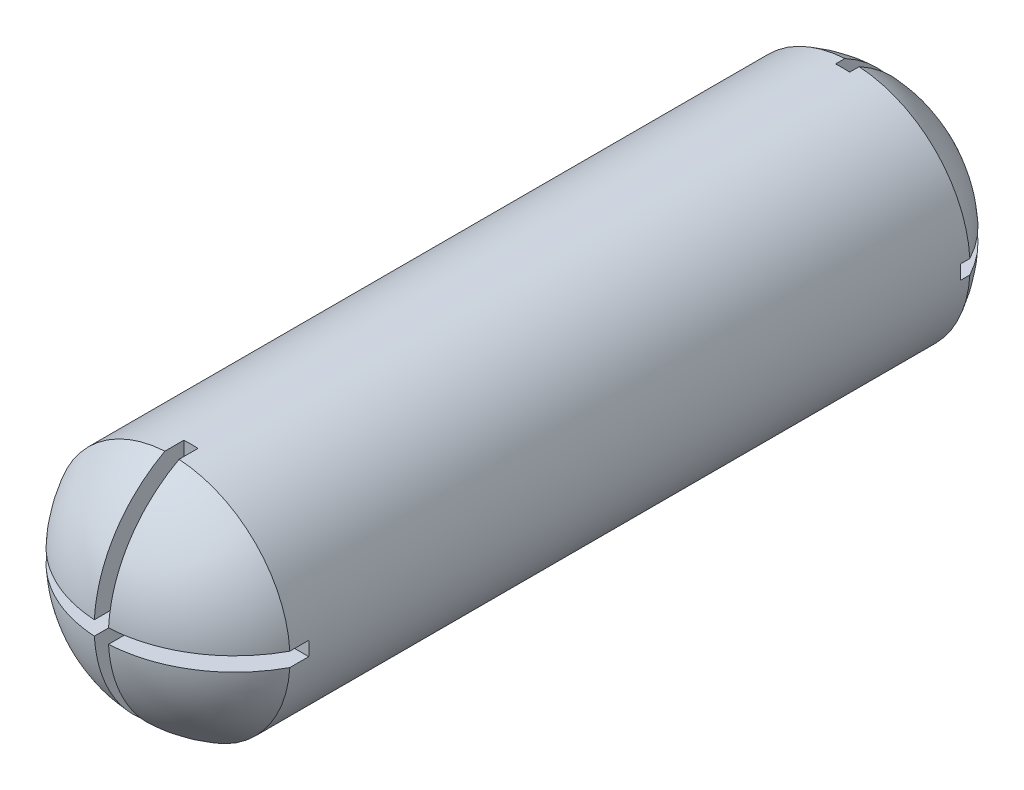
ISO-10303-21;
HEADER;
FILE_DESCRIPTION(('STEP AP214'),'2;1');
FILE_NAME('part.step','',(''),(''),'','','');
FILE_SCHEMA(('AUTOMOTIVE_DESIGN { 1 0 10303 214 1 1 1 1 }'));
ENDSEC;
DATA;
#1=APPLICATION_CONTEXT('core data for automotive mechanical design processes');
#2=APPLICATION_PROTOCOL_DEFINITION('international standard','automotive_design',2000,#1);
#3=PRODUCT_CONTEXT('',#1,'mechanical');
#4=PRODUCT('Part','Part','',(#3));
#5=PRODUCT_RELATED_PRODUCT_CATEGORY('part','',(#4));
#6=PRODUCT_DEFINITION_FORMATION('','',#4);
#7=PRODUCT_DEFINITION_CONTEXT('part definition',#1,'design');
#8=PRODUCT_DEFINITION('design','',#6,#7);
#9=PRODUCT_DEFINITION_SHAPE('','',#8);
#10=(LENGTH_UNIT() NAMED_UNIT(*) SI_UNIT(.MILLI.,.METRE.));
#11=(NAMED_UNIT(*) PLANE_ANGLE_UNIT() SI_UNIT($,.RADIAN.));
#12=(NAMED_UNIT(*) SI_UNIT($,.STERADIAN.) SOLID_ANGLE_UNIT());
#13=UNCERTAINTY_MEASURE_WITH_UNIT(LENGTH_MEASURE(1.E-05),#10,'distance_accuracy_value','');
#14=(GEOMETRIC_REPRESENTATION_CONTEXT(3) GLOBAL_UNCERTAINTY_ASSIGNED_CONTEXT((#13)) GLOBAL_UNIT_ASSIGNED_CONTEXT((#10,
#11,#12)) REPRESENTATION_CONTEXT('',''));
#15=CARTESIAN_POINT('',(0.,0.,0.));
#16=DIRECTION('',(0.,0.,1.));
#17=DIRECTION('',(1.,0.,0.));
#18=AXIS2_PLACEMENT_3D('',#15,#16,#17);
#19=CARTESIAN_POINT('',(0.,0.,144.));
#20=DIRECTION('',(0.,0.,-1.));
#21=DIRECTION('',(-1.,0.,0.));
#22=AXIS2_PLACEMENT_3D('',#19,#20,#21);
#23=CYLINDRICAL_SURFACE('',#22,25.);
#24=DIRECTION('',(0.,0.,-1.));
#25=VECTOR('',#24,1.);
#26=CARTESIAN_POINT('',(1.5,24.9549594269356,2.));
#27=LINE('',#26,#25);
#28=CARTESIAN_POINT('',(1.5,24.9549594269356,2.));
#29=VERTEX_POINT('',#28);
#30=CARTESIAN_POINT('',(1.5,24.9549594269356,0.));
#31=VERTEX_POINT('',#30);
#32=EDGE_CURVE('E359',#29,#31,#27,.T.);
#33=ORIENTED_EDGE('',*,*,#32,.F.);
#34=CARTESIAN_POINT('',(0.,0.,2.));
#35=DIRECTION('',(0.,0.,1.));
#36=DIRECTION('',(1.,0.,0.));
#37=AXIS2_PLACEMENT_3D('',#34,#35,#36);
#38=CIRCLE('',#37,25.);
#39=CARTESIAN_POINT('',(-1.5,24.9549594269356,2.));
#40=VERTEX_POINT('',#39);
#41=EDGE_CURVE('E288',#29,#40,#38,.T.);
#42=ORIENTED_EDGE('',*,*,#41,.T.);
#43=DIRECTION('',(0.,0.,-1.));
#44=VECTOR('',#43,1.);
#45=CARTESIAN_POINT('',(-1.5,24.9549594269356,2.));
#46=LINE('',#45,#44);
#47=CARTESIAN_POINT('',(-1.5,24.9549594269356,0.));
#48=VERTEX_POINT('',#47);
#49=EDGE_CURVE('E355',#40,#48,#46,.T.);
#50=ORIENTED_EDGE('',*,*,#49,.T.);
#51=CARTESIAN_POINT('',(0.,0.,0.));
#52=DIRECTION('',(0.,0.,1.));
#53=DIRECTION('',(1.,0.,0.));
#54=AXIS2_PLACEMENT_3D('',#51,#52,#53);
#55=CIRCLE('',#54,25.);
#56=CARTESIAN_POINT('',(-24.9549594269356,1.5,0.));
#57=VERTEX_POINT('',#56);
#58=EDGE_CURVE('E374',#48,#57,#55,.T.);
#59=ORIENTED_EDGE('',*,*,#58,.T.);
#60=DIRECTION('',(0.,0.,-1.));
#61=VECTOR('',#60,1.);
#62=CARTESIAN_POINT('',(-24.9549594269356,1.5,2.));
#63=LINE('',#62,#61);
#64=CARTESIAN_POINT('',(-24.9549594269356,1.5,2.));
#65=VERTEX_POINT('',#64);
#66=EDGE_CURVE('E348',#65,#57,#63,.T.);
#67=ORIENTED_EDGE('',*,*,#66,.F.);
#68=CARTESIAN_POINT('',(-24.9549594269356,-1.5,2.));
#69=VERTEX_POINT('',#68);
#70=EDGE_CURVE('E294',#65,#69,#38,.T.);
#71=ORIENTED_EDGE('',*,*,#70,.T.);
#72=DIRECTION('',(0.,0.,-1.));
#73=VECTOR('',#72,1.);
#74=CARTESIAN_POINT('',(-24.9549594269356,-1.5,2.));
#75=LINE('',#74,#73);
#76=CARTESIAN_POINT('',(-24.9549594269356,-1.5,0.));
#77=VERTEX_POINT('',#76);
#78=EDGE_CURVE('E344',#69,#77,#75,.T.);
#79=ORIENTED_EDGE('',*,*,#78,.T.);
#80=CARTESIAN_POINT('',(-1.5,-24.9549594269356,0.));
#81=VERTEX_POINT('',#80);
#82=EDGE_CURVE('E725',#77,#81,#55,.T.);
#83=ORIENTED_EDGE('',*,*,#82,.T.);
#84=DIRECTION('',(0.,0.,-1.));
#85=VECTOR('',#84,1.);
#86=CARTESIAN_POINT('',(-1.5,-24.9549594269356,2.));
#87=LINE('',#86,#85);
#88=CARTESIAN_POINT('',(-1.5,-24.9549594269356,2.));
#89=VERTEX_POINT('',#88);
#90=EDGE_CURVE('E337',#89,#81,#87,.T.);
#91=ORIENTED_EDGE('',*,*,#90,.F.);
#92=CARTESIAN_POINT('',(1.5,-24.9549594269356,2.));
#93=VERTEX_POINT('',#92);
#94=EDGE_CURVE('E309',#89,#93,#38,.T.);
#95=ORIENTED_EDGE('',*,*,#94,.T.);
#96=DIRECTION('',(0.,0.,-1.));
#97=VECTOR('',#96,1.);
#98=CARTESIAN_POINT('',(1.5,-24.9549594269356,2.));
#99=LINE('',#98,#97);
#100=CARTESIAN_POINT('',(1.5,-24.9549594269356,0.));
#101=VERTEX_POINT('',#100);
#102=EDGE_CURVE('E333',#93,#101,#99,.T.);
#103=ORIENTED_EDGE('',*,*,#102,.T.);
#104=CARTESIAN_POINT('',(24.9549594269356,-1.5,0.));
#105=VERTEX_POINT('',#104);
#106=EDGE_CURVE('E362',#101,#105,#55,.T.);
#107=ORIENTED_EDGE('',*,*,#106,.T.);
#108=DIRECTION('',(0.,0.,-1.));
#109=VECTOR('',#108,1.);
#110=CARTESIAN_POINT('',(24.9549594269356,-1.5,2.));
#111=LINE('',#110,#109);
#112=CARTESIAN_POINT('',(24.9549594269356,-1.5,2.));
#113=VERTEX_POINT('',#112);
#114=EDGE_CURVE('E326',#113,#105,#111,.T.);
#115=ORIENTED_EDGE('',*,*,#114,.F.);
#116=CARTESIAN_POINT('',(24.9549594269356,1.5,2.));
#117=VERTEX_POINT('',#116);
#118=EDGE_CURVE('E293',#113,#117,#38,.T.);
#119=ORIENTED_EDGE('',*,*,#118,.T.);
#120=DIRECTION('',(0.,0.,-1.));
#121=VECTOR('',#120,1.);
#122=CARTESIAN_POINT('',(24.9549594269356,1.5,2.));
#123=LINE('',#122,#121);
#124=CARTESIAN_POINT('',(24.9549594269356,1.5,0.));
#125=VERTEX_POINT('',#124);
#126=EDGE_CURVE('E322',#117,#125,#123,.T.);
#127=ORIENTED_EDGE('',*,*,#126,.T.);
#128=EDGE_CURVE('E370',#125,#31,#55,.T.);
#129=ORIENTED_EDGE('',*,*,#128,.T.);
#130=EDGE_LOOP('',(#33,#42,#50,#59,#67,#71,#79,#83,#91,#95,#103,#107,#115,#119,#127,#129));
#131=FACE_BOUND('',#130,.T.);
#132=DIRECTION('',(0.,0.,-1.));
#133=VECTOR('',#132,1.);
#134=CARTESIAN_POINT('',(-1.5,24.9549594269356,144.));
#135=LINE('',#134,#133);
#136=CARTESIAN_POINT('',(-1.5,24.9549594269356,140.));
#137=VERTEX_POINT('',#136);
#138=CARTESIAN_POINT('',(-1.5,24.9549594269356,144.));
#139=VERTEX_POINT('',#138);
#140=EDGE_CURVE('E268',#137,#139,#135,.F.);
#141=ORIENTED_EDGE('',*,*,#140,.F.);
#142=CARTESIAN_POINT('',(0.,0.,140.));
#143=DIRECTION('',(0.,0.,1.));
#144=DIRECTION('',(1.,0.,0.));
#145=AXIS2_PLACEMENT_3D('',#142,#143,#144);
#146=CIRCLE('',#145,25.);
#147=CARTESIAN_POINT('',(1.5,24.9549594269356,140.));
#148=VERTEX_POINT('',#147);
#149=EDGE_CURVE('E11',#148,#137,#146,.T.);
#150=ORIENTED_EDGE('',*,*,#149,.F.);
#151=DIRECTION('',(0.,0.,-1.));
#152=VECTOR('',#151,1.);
#153=CARTESIAN_POINT('',(1.5,24.9549594269356,144.));
#154=LINE('',#153,#152);
#155=CARTESIAN_POINT('',(1.5,24.9549594269356,144.));
#156=VERTEX_POINT('',#155);
#157=EDGE_CURVE('E264',#148,#156,#154,.F.);
#158=ORIENTED_EDGE('',*,*,#157,.T.);
#159=CARTESIAN_POINT('',(0.,0.,144.));
#160=DIRECTION('',(0.,0.,1.));
#161=DIRECTION('',(1.,0.,0.));
#162=AXIS2_PLACEMENT_3D('',#159,#160,#161);
#163=CIRCLE('',#162,25.);
#164=CARTESIAN_POINT('',(24.9549594269356,1.5,144.));
#165=VERTEX_POINT('',#164);
#166=EDGE_CURVE('E363',#165,#156,#163,.T.);
#167=ORIENTED_EDGE('',*,*,#166,.F.);
#168=DIRECTION('',(0.,0.,-1.));
#169=VECTOR('',#168,1.);
#170=CARTESIAN_POINT('',(24.9549594269356,1.5,144.));
#171=LINE('',#170,#169);
#172=CARTESIAN_POINT('',(24.9549594269356,1.5,140.));
#173=VERTEX_POINT('',#172);
#174=EDGE_CURVE('E261',#173,#165,#171,.F.);
#175=ORIENTED_EDGE('',*,*,#174,.F.);
#176=CARTESIAN_POINT('',(24.9549594269356,-1.5,140.));
#177=VERTEX_POINT('',#176);
#178=EDGE_CURVE('E43',#177,#173,#146,.T.);
#179=ORIENTED_EDGE('',*,*,#178,.F.);
#180=DIRECTION('',(0.,0.,-1.));
#181=VECTOR('',#180,1.);
#182=CARTESIAN_POINT('',(24.9549594269356,-1.5,144.));
#183=LINE('',#182,#181);
#184=CARTESIAN_POINT('',(24.9549594269356,-1.5,144.));
#185=VERTEX_POINT('',#184);
#186=EDGE_CURVE('E223',#177,#185,#183,.F.);
#187=ORIENTED_EDGE('',*,*,#186,.T.);
#188=CARTESIAN_POINT('',(1.5,-24.9549594269356,144.));
#189=VERTEX_POINT('',#188);
#190=EDGE_CURVE('E369',#189,#185,#163,.T.);
#191=ORIENTED_EDGE('',*,*,#190,.F.);
#192=DIRECTION('',(0.,0.,-1.));
#193=VECTOR('',#192,1.);
#194=CARTESIAN_POINT('',(1.5,-24.9549594269356,144.));
#195=LINE('',#194,#193);
#196=CARTESIAN_POINT('',(1.5,-24.9549594269356,140.));
#197=VERTEX_POINT('',#196);
#198=EDGE_CURVE('E281',#189,#197,#195,.T.);
#199=ORIENTED_EDGE('',*,*,#198,.T.);
#200=CARTESIAN_POINT('',(-1.5,-24.9549594269356,140.));
#201=VERTEX_POINT('',#200);
#202=EDGE_CURVE('E208',#201,#197,#146,.T.);
#203=ORIENTED_EDGE('',*,*,#202,.F.);
#204=DIRECTION('',(0.,0.,-1.));
#205=VECTOR('',#204,1.);
#206=CARTESIAN_POINT('',(-1.5,-24.9549594269356,144.));
#207=LINE('',#206,#205);
#208=CARTESIAN_POINT('',(-1.5,-24.9549594269356,144.));
#209=VERTEX_POINT('',#208);
#210=EDGE_CURVE('E278',#209,#201,#207,.T.);
#211=ORIENTED_EDGE('',*,*,#210,.F.);
#212=CARTESIAN_POINT('',(-24.9549594269356,-1.5,144.));
#213=VERTEX_POINT('',#212);
#214=EDGE_CURVE('E446',#213,#209,#163,.T.);
#215=ORIENTED_EDGE('',*,*,#214,.F.);
#216=DIRECTION('',(0.,0.,-1.));
#217=VECTOR('',#216,1.);
#218=CARTESIAN_POINT('',(-24.9549594269356,-1.5,144.));
#219=LINE('',#218,#217);
#220=CARTESIAN_POINT('',(-24.9549594269356,-1.5,140.));
#221=VERTEX_POINT('',#220);
#222=EDGE_CURVE('E274',#213,#221,#219,.T.);
#223=ORIENTED_EDGE('',*,*,#222,.T.);
#224=CARTESIAN_POINT('',(-24.9549594269356,1.5,140.));
#225=VERTEX_POINT('',#224);
#226=EDGE_CURVE('E49',#225,#221,#146,.T.);
#227=ORIENTED_EDGE('',*,*,#226,.F.);
#228=DIRECTION('',(0.,0.,-1.));
#229=VECTOR('',#228,1.);
#230=CARTESIAN_POINT('',(-24.9549594269356,1.5,144.));
#231=LINE('',#230,#229);
#232=CARTESIAN_POINT('',(-24.9549594269356,1.5,144.));
#233=VERTEX_POINT('',#232);
#234=EDGE_CURVE('E271',#233,#225,#231,.T.);
#235=ORIENTED_EDGE('',*,*,#234,.F.);
#236=EDGE_CURVE('E368',#139,#233,#163,.T.);
#237=ORIENTED_EDGE('',*,*,#236,.F.);
#238=EDGE_LOOP('',(#141,#150,#158,#167,#175,#179,#187,#191,#199,#203,#211,#215,#223,#227,#235,#237));
#239=FACE_BOUND('',#238,.T.);
#240=ADVANCED_FACE('F39',(#131,#239),#23,.T.);
#241=CARTESIAN_POINT('',(0.,0.,130.666666666667));
#242=DIRECTION('',(0.,0.,1.));
#243=DIRECTION('',(1.,0.,0.));
#244=AXIS2_PLACEMENT_3D('',#241,#242,#243);
#245=SPHERICAL_SURFACE('',#244,28.3333333333333);
#246=ORIENTED_EDGE('',*,*,#214,.T.);
#247=CARTESIAN_POINT('',(-1.5,0.,130.666666666667));
#248=DIRECTION('',(1.,0.,0.));
#249=DIRECTION('',(0.,0.,-1.));
#250=AXIS2_PLACEMENT_3D('',#247,#248,#249);
#251=CIRCLE('',#250,28.2935995903275);
#252=CARTESIAN_POINT('',(-1.5,-1.5,158.920476635904));
#253=VERTEX_POINT('',#252);
#254=EDGE_CURVE('E424',#209,#253,#251,.F.);
#255=ORIENTED_EDGE('',*,*,#254,.T.);
#256=CARTESIAN_POINT('',(0.,-1.5,130.666666666667));
#257=DIRECTION('',(0.,-1.,0.));
#258=DIRECTION('',(0.,0.,-1.));
#259=AXIS2_PLACEMENT_3D('',#256,#257,#258);
#260=CIRCLE('',#259,28.2935995903275);
#261=EDGE_CURVE('E422',#213,#253,#260,.F.);
#262=ORIENTED_EDGE('',*,*,#261,.F.);
#263=EDGE_LOOP('',(#246,#255,#262));
#264=FACE_BOUND('',#263,.T.);
#265=ADVANCED_FACE('F475',(#264),#245,.T.);
#266=ORIENTED_EDGE('',*,*,#236,.T.);
#267=CARTESIAN_POINT('',(0.,1.5,130.666666666667));
#268=DIRECTION('',(0.,-1.,0.));
#269=DIRECTION('',(0.,0.,-1.));
#270=AXIS2_PLACEMENT_3D('',#267,#268,#269);
#271=CIRCLE('',#270,28.2935995903275);
#272=CARTESIAN_POINT('',(-1.5,1.5,158.920476635904));
#273=VERTEX_POINT('',#272);
#274=EDGE_CURVE('E418',#233,#273,#271,.F.);
#275=ORIENTED_EDGE('',*,*,#274,.T.);
#276=CARTESIAN_POINT('',(-1.5,0.,130.666666666667));
#277=DIRECTION('',(1.,0.,0.));
#278=DIRECTION('',(0.,0.,-1.));
#279=AXIS2_PLACEMENT_3D('',#276,#277,#278);
#280=CIRCLE('',#279,28.2935995903275);
#281=EDGE_CURVE('E414',#273,#139,#280,.F.);
#282=ORIENTED_EDGE('',*,*,#281,.T.);
#283=EDGE_LOOP('',(#266,#275,#282));
#284=FACE_BOUND('',#283,.T.);
#285=ADVANCED_FACE('F473',(#284),#245,.T.);
#286=CARTESIAN_POINT('',(1.5,0.,130.666666666667));
#287=DIRECTION('',(1.,0.,0.));
#288=DIRECTION('',(0.,0.,-1.));
#289=AXIS2_PLACEMENT_3D('',#286,#287,#288);
#290=CIRCLE('',#289,28.2935995903275);
#291=CARTESIAN_POINT('',(1.5,1.5,158.920476635904));
#292=VERTEX_POINT('',#291);
#293=EDGE_CURVE('E411',#292,#156,#290,.F.);
#294=ORIENTED_EDGE('',*,*,#293,.F.);
#295=CARTESIAN_POINT('',(0.,1.5,130.666666666667));
#296=DIRECTION('',(0.,-1.,0.));
#297=DIRECTION('',(0.,0.,-1.));
#298=AXIS2_PLACEMENT_3D('',#295,#296,#297);
#299=CIRCLE('',#298,28.2935995903275);
#300=EDGE_CURVE('E407',#292,#165,#299,.F.);
#301=ORIENTED_EDGE('',*,*,#300,.T.);
#302=ORIENTED_EDGE('',*,*,#166,.T.);
#303=EDGE_LOOP('',(#294,#301,#302));
#304=FACE_BOUND('',#303,.T.);
#305=ADVANCED_FACE('F461',(#304),#245,.T.);
#306=CARTESIAN_POINT('',(0.,0.,13.3333333333333));
#307=DIRECTION('',(0.,0.,1.));
#308=DIRECTION('',(1.,0.,0.));
#309=AXIS2_PLACEMENT_3D('',#306,#307,#308);
#310=SPHERICAL_SURFACE('',#309,28.3333333333333);
#311=ORIENTED_EDGE('',*,*,#58,.F.);
#312=CARTESIAN_POINT('',(-1.5,0.,13.3333333333333));
#313=DIRECTION('',(-1.,0.,0.));
#314=DIRECTION('',(0.,-1.,0.));
#315=AXIS2_PLACEMENT_3D('',#312,#313,#314);
#316=CIRCLE('',#315,28.2935995903275);
#317=CARTESIAN_POINT('',(-1.5,1.5,-14.9204766359041));
#318=VERTEX_POINT('',#317);
#319=EDGE_CURVE('E398',#48,#318,#316,.T.);
#320=ORIENTED_EDGE('',*,*,#319,.T.);
#321=CARTESIAN_POINT('',(0.,1.5,13.3333333333333));
#322=DIRECTION('',(0.,-1.,0.));
#323=DIRECTION('',(1.,0.,0.));
#324=AXIS2_PLACEMENT_3D('',#321,#322,#323);
#325=CIRCLE('',#324,28.2935995903275);
#326=EDGE_CURVE('E395',#57,#318,#325,.T.);
#327=ORIENTED_EDGE('',*,*,#326,.F.);
#328=EDGE_LOOP('',(#311,#320,#327));
#329=FACE_BOUND('',#328,.T.);
#330=ADVANCED_FACE('F480',(#329),#310,.T.);
#331=CARTESIAN_POINT('',(1.5,0.,13.3333333333333));
#332=DIRECTION('',(-1.,0.,0.));
#333=DIRECTION('',(0.,-1.,0.));
#334=AXIS2_PLACEMENT_3D('',#331,#332,#333);
#335=CIRCLE('',#334,28.2935995903275);
#336=CARTESIAN_POINT('',(1.5,-1.5,-14.9204766359041));
#337=VERTEX_POINT('',#336);
#338=EDGE_CURVE('E384',#337,#101,#335,.T.);
#339=ORIENTED_EDGE('',*,*,#338,.F.);
#340=CARTESIAN_POINT('',(0.,-1.5,13.3333333333333));
#341=DIRECTION('',(0.,-1.,0.));
#342=DIRECTION('',(1.,0.,0.));
#343=AXIS2_PLACEMENT_3D('',#340,#341,#342);
#344=CIRCLE('',#343,28.2935995903275);
#345=EDGE_CURVE('E380',#337,#105,#344,.T.);
#346=ORIENTED_EDGE('',*,*,#345,.T.);
#347=ORIENTED_EDGE('',*,*,#106,.F.);
#348=EDGE_LOOP('',(#339,#346,#347));
#349=FACE_BOUND('',#348,.T.);
#350=ADVANCED_FACE('F700',(#349),#310,.T.);
#351=CARTESIAN_POINT('',(1.5,0.,13.3333333333333));
#352=DIRECTION('',(-1.,0.,0.));
#353=DIRECTION('',(0.,-1.,0.));
#354=AXIS2_PLACEMENT_3D('',#351,#352,#353);
#355=CIRCLE('',#354,28.2935995903275);
#356=CARTESIAN_POINT('',(1.5,1.5,-14.9204766359041));
#357=VERTEX_POINT('',#356);
#358=EDGE_CURVE('E377',#31,#357,#355,.T.);
#359=ORIENTED_EDGE('',*,*,#358,.F.);
#360=ORIENTED_EDGE('',*,*,#128,.F.);
#361=CARTESIAN_POINT('',(0.,1.5,13.3333333333333));
#362=DIRECTION('',(0.,-1.,0.));
#363=DIRECTION('',(1.,0.,0.));
#364=AXIS2_PLACEMENT_3D('',#361,#362,#363);
#365=CIRCLE('',#364,28.2935995903275);
#366=EDGE_CURVE('E367',#357,#125,#365,.T.);
#367=ORIENTED_EDGE('',*,*,#366,.F.);
#368=EDGE_LOOP('',(#359,#360,#367));
#369=FACE_BOUND('',#368,.T.);
#370=ADVANCED_FACE('F690',(#369),#310,.T.);
#371=CARTESIAN_POINT('',(1.5,0.,130.666666666667));
#372=DIRECTION('',(1.,0.,0.));
#373=DIRECTION('',(0.,0.,-1.));
#374=AXIS2_PLACEMENT_3D('',#371,#372,#373);
#375=CIRCLE('',#374,28.2935995903275);
#376=CARTESIAN_POINT('',(1.5,-1.5,158.920476635904));
#377=VERTEX_POINT('',#376);
#378=EDGE_CURVE('E215',#189,#377,#375,.F.);
#379=ORIENTED_EDGE('',*,*,#378,.F.);
#380=ORIENTED_EDGE('',*,*,#190,.T.);
#381=CARTESIAN_POINT('',(0.,-1.5,130.666666666667));
#382=DIRECTION('',(0.,-1.,0.));
#383=DIRECTION('',(0.,0.,-1.));
#384=AXIS2_PLACEMENT_3D('',#381,#382,#383);
#385=CIRCLE('',#384,28.2935995903275);
#386=EDGE_CURVE('E402',#377,#185,#385,.F.);
#387=ORIENTED_EDGE('',*,*,#386,.F.);
#388=EDGE_LOOP('',(#379,#380,#387));
#389=FACE_BOUND('',#388,.T.);
#390=ADVANCED_FACE('F454',(#389),#245,.T.);
#391=ORIENTED_EDGE('',*,*,#82,.F.);
#392=CARTESIAN_POINT('',(0.,-1.5,13.3333333333333));
#393=DIRECTION('',(0.,-1.,0.));
#394=DIRECTION('',(1.,0.,0.));
#395=AXIS2_PLACEMENT_3D('',#392,#393,#394);
#396=CIRCLE('',#395,28.2935995903275);
#397=CARTESIAN_POINT('',(-1.5,-1.5,-14.9204766359041));
#398=VERTEX_POINT('',#397);
#399=EDGE_CURVE('E391',#77,#398,#396,.T.);
#400=ORIENTED_EDGE('',*,*,#399,.T.);
#401=CARTESIAN_POINT('',(-1.5,0.,13.3333333333333));
#402=DIRECTION('',(-1.,0.,0.));
#403=DIRECTION('',(0.,-1.,0.));
#404=AXIS2_PLACEMENT_3D('',#401,#402,#403);
#405=CIRCLE('',#404,28.2935995903275);
#406=EDGE_CURVE('E387',#398,#81,#405,.T.);
#407=ORIENTED_EDGE('',*,*,#406,.T.);
#408=EDGE_LOOP('',(#391,#400,#407));
#409=FACE_BOUND('',#408,.T.);
#410=ADVANCED_FACE('F41',(#409),#310,.T.);
#411=CARTESIAN_POINT('',(1.5,0.,2.));
#412=DIRECTION('',(-1.,0.,0.));
#413=DIRECTION('',(0.,-1.,0.));
#414=AXIS2_PLACEMENT_3D('',#411,#412,#413);
#415=PLANE('',#414);
#416=ORIENTED_EDGE('',*,*,#358,.T.);
#417=DIRECTION('',(0.,0.,-1.));
#418=VECTOR('',#417,1.);
#419=CARTESIAN_POINT('',(1.5,1.5,2.));
#420=LINE('',#419,#418);
#421=CARTESIAN_POINT('',(1.5,1.5,2.));
#422=VERTEX_POINT('',#421);
#423=EDGE_CURVE('E64',#422,#357,#420,.T.);
#424=ORIENTED_EDGE('',*,*,#423,.F.);
#425=DIRECTION('',(0.,1.,0.));
#426=VECTOR('',#425,1.);
#427=CARTESIAN_POINT('',(1.5,0.,2.));
#428=LINE('',#427,#426);
#429=EDGE_CURVE('E284',#422,#29,#428,.T.);
#430=ORIENTED_EDGE('',*,*,#429,.T.);
#431=ORIENTED_EDGE('',*,*,#32,.T.);
#432=EDGE_LOOP('',(#416,#424,#430,#431));
#433=FACE_BOUND('',#432,.T.);
#434=ADVANCED_FACE('F488',(#433),#415,.T.);
#435=CARTESIAN_POINT('',(-1.5,0.,2.));
#436=DIRECTION('',(-1.,0.,0.));
#437=DIRECTION('',(0.,-1.,0.));
#438=AXIS2_PLACEMENT_3D('',#435,#436,#437);
#439=PLANE('',#438);
#440=ORIENTED_EDGE('',*,*,#49,.F.);
#441=DIRECTION('',(0.,1.,0.));
#442=VECTOR('',#441,1.);
#443=CARTESIAN_POINT('',(-1.5,0.,2.));
#444=LINE('',#443,#442);
#445=CARTESIAN_POINT('',(-1.5,1.5,2.));
#446=VERTEX_POINT('',#445);
#447=EDGE_CURVE('E292',#446,#40,#444,.T.);
#448=ORIENTED_EDGE('',*,*,#447,.F.);
#449=DIRECTION('',(0.,0.,-1.));
#450=VECTOR('',#449,1.);
#451=CARTESIAN_POINT('',(-1.5,1.5,2.));
#452=LINE('',#451,#450);
#453=EDGE_CURVE('E351',#446,#318,#452,.T.);
#454=ORIENTED_EDGE('',*,*,#453,.T.);
#455=ORIENTED_EDGE('',*,*,#319,.F.);
#456=EDGE_LOOP('',(#440,#448,#454,#455));
#457=FACE_BOUND('',#456,.T.);
#458=ADVANCED_FACE('F491',(#457),#439,.F.);
#459=CARTESIAN_POINT('',(0.,1.5,2.));
#460=DIRECTION('',(0.,-1.,0.));
#461=DIRECTION('',(1.,0.,0.));
#462=AXIS2_PLACEMENT_3D('',#459,#460,#461);
#463=PLANE('',#462);
#464=ORIENTED_EDGE('',*,*,#326,.T.);
#465=ORIENTED_EDGE('',*,*,#453,.F.);
#466=DIRECTION('',(-1.,0.,0.));
#467=VECTOR('',#466,1.);
#468=CARTESIAN_POINT('',(0.,1.5,2.));
#469=LINE('',#468,#467);
#470=EDGE_CURVE('E298',#446,#65,#469,.T.);
#471=ORIENTED_EDGE('',*,*,#470,.T.);
#472=ORIENTED_EDGE('',*,*,#66,.T.);
#473=EDGE_LOOP('',(#464,#465,#471,#472));
#474=FACE_BOUND('',#473,.T.);
#475=ADVANCED_FACE('F495',(#474),#463,.T.);
#476=CARTESIAN_POINT('',(0.,-1.5,2.));
#477=DIRECTION('',(0.,-1.,0.));
#478=DIRECTION('',(1.,0.,0.));
#479=AXIS2_PLACEMENT_3D('',#476,#477,#478);
#480=PLANE('',#479);
#481=ORIENTED_EDGE('',*,*,#78,.F.);
#482=DIRECTION('',(-1.,0.,0.));
#483=VECTOR('',#482,1.);
#484=CARTESIAN_POINT('',(0.,-1.5,2.));
#485=LINE('',#484,#483);
#486=CARTESIAN_POINT('',(-1.5,-1.5,2.));
#487=VERTEX_POINT('',#486);
#488=EDGE_CURVE('E301',#487,#69,#485,.T.);
#489=ORIENTED_EDGE('',*,*,#488,.F.);
#490=DIRECTION('',(0.,0.,-1.));
#491=VECTOR('',#490,1.);
#492=CARTESIAN_POINT('',(-1.5,-1.5,2.));
#493=LINE('',#492,#491);
#494=EDGE_CURVE('E340',#487,#398,#493,.T.);
#495=ORIENTED_EDGE('',*,*,#494,.T.);
#496=ORIENTED_EDGE('',*,*,#399,.F.);
#497=EDGE_LOOP('',(#481,#489,#495,#496));
#498=FACE_BOUND('',#497,.T.);
#499=ADVANCED_FACE('F499',(#498),#480,.F.);
#500=CARTESIAN_POINT('',(-1.5,0.,2.));
#501=DIRECTION('',(-1.,0.,0.));
#502=DIRECTION('',(0.,-1.,0.));
#503=AXIS2_PLACEMENT_3D('',#500,#501,#502);
#504=PLANE('',#503);
#505=ORIENTED_EDGE('',*,*,#494,.F.);
#506=DIRECTION('',(0.,1.,0.));
#507=VECTOR('',#506,1.);
#508=CARTESIAN_POINT('',(-1.5,0.,2.));
#509=LINE('',#508,#507);
#510=EDGE_CURVE('E305',#89,#487,#509,.T.);
#511=ORIENTED_EDGE('',*,*,#510,.F.);
#512=ORIENTED_EDGE('',*,*,#90,.T.);
#513=ORIENTED_EDGE('',*,*,#406,.F.);
#514=EDGE_LOOP('',(#505,#511,#512,#513));
#515=FACE_BOUND('',#514,.T.);
#516=ADVANCED_FACE('F503',(#515),#504,.F.);
#517=CARTESIAN_POINT('',(1.5,0.,2.));
#518=DIRECTION('',(-1.,0.,0.));
#519=DIRECTION('',(0.,-1.,0.));
#520=AXIS2_PLACEMENT_3D('',#517,#518,#519);
#521=PLANE('',#520);
#522=ORIENTED_EDGE('',*,*,#338,.T.);
#523=ORIENTED_EDGE('',*,*,#102,.F.);
#524=DIRECTION('',(0.,1.,0.));
#525=VECTOR('',#524,1.);
#526=CARTESIAN_POINT('',(1.5,0.,2.));
#527=LINE('',#526,#525);
#528=CARTESIAN_POINT('',(1.5,-1.5,2.));
#529=VERTEX_POINT('',#528);
#530=EDGE_CURVE('E310',#93,#529,#527,.T.);
#531=ORIENTED_EDGE('',*,*,#530,.T.);
#532=DIRECTION('',(0.,0.,-1.));
#533=VECTOR('',#532,1.);
#534=CARTESIAN_POINT('',(1.5,-1.5,2.));
#535=LINE('',#534,#533);
#536=EDGE_CURVE('E329',#529,#337,#535,.T.);
#537=ORIENTED_EDGE('',*,*,#536,.T.);
#538=EDGE_LOOP('',(#522,#523,#531,#537));
#539=FACE_BOUND('',#538,.T.);
#540=ADVANCED_FACE('F507',(#539),#521,.T.);
#541=CARTESIAN_POINT('',(0.,-1.5,2.));
#542=DIRECTION('',(0.,-1.,0.));
#543=DIRECTION('',(1.,0.,0.));
#544=AXIS2_PLACEMENT_3D('',#541,#542,#543);
#545=PLANE('',#544);
#546=ORIENTED_EDGE('',*,*,#536,.F.);
#547=DIRECTION('',(-1.,0.,0.));
#548=VECTOR('',#547,1.);
#549=CARTESIAN_POINT('',(0.,-1.5,2.));
#550=LINE('',#549,#548);
#551=EDGE_CURVE('E313',#113,#529,#550,.T.);
#552=ORIENTED_EDGE('',*,*,#551,.F.);
#553=ORIENTED_EDGE('',*,*,#114,.T.);
#554=ORIENTED_EDGE('',*,*,#345,.F.);
#555=EDGE_LOOP('',(#546,#552,#553,#554));
#556=FACE_BOUND('',#555,.T.);
#557=ADVANCED_FACE('F511',(#556),#545,.F.);
#558=CARTESIAN_POINT('',(0.,1.5,2.));
#559=DIRECTION('',(0.,-1.,0.));
#560=DIRECTION('',(1.,0.,0.));
#561=AXIS2_PLACEMENT_3D('',#558,#559,#560);
#562=PLANE('',#561);
#563=ORIENTED_EDGE('',*,*,#366,.T.);
#564=ORIENTED_EDGE('',*,*,#126,.F.);
#565=DIRECTION('',(-1.,0.,0.));
#566=VECTOR('',#565,1.);
#567=CARTESIAN_POINT('',(0.,1.5,2.));
#568=LINE('',#567,#566);
#569=EDGE_CURVE('E317',#117,#422,#568,.T.);
#570=ORIENTED_EDGE('',*,*,#569,.T.);
#571=ORIENTED_EDGE('',*,*,#423,.T.);
#572=EDGE_LOOP('',(#563,#564,#570,#571));
#573=FACE_BOUND('',#572,.T.);
#574=ADVANCED_FACE('F515',(#573),#562,.T.);
#575=CARTESIAN_POINT('',(0.,0.,2.));
#576=DIRECTION('',(0.,0.,1.));
#577=DIRECTION('',(1.,0.,0.));
#578=AXIS2_PLACEMENT_3D('',#575,#576,#577);
#579=PLANE('',#578);
#580=ORIENTED_EDGE('',*,*,#429,.F.);
#581=ORIENTED_EDGE('',*,*,#569,.F.);
#582=ORIENTED_EDGE('',*,*,#118,.F.);
#583=ORIENTED_EDGE('',*,*,#551,.T.);
#584=ORIENTED_EDGE('',*,*,#530,.F.);
#585=ORIENTED_EDGE('',*,*,#94,.F.);
#586=ORIENTED_EDGE('',*,*,#510,.T.);
#587=ORIENTED_EDGE('',*,*,#488,.T.);
#588=ORIENTED_EDGE('',*,*,#70,.F.);
#589=ORIENTED_EDGE('',*,*,#470,.F.);
#590=ORIENTED_EDGE('',*,*,#447,.T.);
#591=ORIENTED_EDGE('',*,*,#41,.F.);
#592=EDGE_LOOP('',(#580,#581,#582,#583,#584,#585,#586,#587,#588,#589,#590,#591));
#593=FACE_BOUND('',#592,.T.);
#594=ADVANCED_FACE('F519',(#593),#579,.F.);
#595=CARTESIAN_POINT('',(0.,0.,140.));
#596=DIRECTION('',(0.,0.,1.));
#597=DIRECTION('',(1.,0.,0.));
#598=AXIS2_PLACEMENT_3D('',#595,#596,#597);
#599=PLANE('',#598);
#600=ORIENTED_EDGE('',*,*,#149,.T.);
#601=DIRECTION('',(0.,1.,0.));
#602=VECTOR('',#601,1.);
#603=CARTESIAN_POINT('',(-1.5,0.,140.));
#604=LINE('',#603,#602);
#605=CARTESIAN_POINT('',(-1.5,1.5,140.));
#606=VERTEX_POINT('',#605);
#607=EDGE_CURVE('E235',#606,#137,#604,.T.);
#608=ORIENTED_EDGE('',*,*,#607,.F.);
#609=DIRECTION('',(1.,0.,0.));
#610=VECTOR('',#609,1.);
#611=CARTESIAN_POINT('',(0.,1.5,140.));
#612=LINE('',#611,#610);
#613=EDGE_CURVE('E239',#225,#606,#612,.T.);
#614=ORIENTED_EDGE('',*,*,#613,.F.);
#615=ORIENTED_EDGE('',*,*,#226,.T.);
#616=DIRECTION('',(1.,0.,0.));
#617=VECTOR('',#616,1.);
#618=CARTESIAN_POINT('',(0.,-1.5,140.));
#619=LINE('',#618,#617);
#620=CARTESIAN_POINT('',(-1.5,-1.5,140.));
#621=VERTEX_POINT('',#620);
#622=EDGE_CURVE('E242',#221,#621,#619,.T.);
#623=ORIENTED_EDGE('',*,*,#622,.T.);
#624=DIRECTION('',(0.,1.,0.));
#625=VECTOR('',#624,1.);
#626=CARTESIAN_POINT('',(-1.5,0.,140.));
#627=LINE('',#626,#625);
#628=EDGE_CURVE('E219',#201,#621,#627,.T.);
#629=ORIENTED_EDGE('',*,*,#628,.F.);
#630=ORIENTED_EDGE('',*,*,#202,.T.);
#631=DIRECTION('',(0.,1.,0.));
#632=VECTOR('',#631,1.);
#633=CARTESIAN_POINT('',(1.5,0.,140.));
#634=LINE('',#633,#632);
#635=CARTESIAN_POINT('',(1.5,-1.5,140.));
#636=VERTEX_POINT('',#635);
#637=EDGE_CURVE('E202',#197,#636,#634,.T.);
#638=ORIENTED_EDGE('',*,*,#637,.T.);
#639=DIRECTION('',(1.,0.,0.));
#640=VECTOR('',#639,1.);
#641=CARTESIAN_POINT('',(0.,-1.5,140.));
#642=LINE('',#641,#640);
#643=EDGE_CURVE('E204',#636,#177,#642,.T.);
#644=ORIENTED_EDGE('',*,*,#643,.T.);
#645=ORIENTED_EDGE('',*,*,#178,.T.);
#646=DIRECTION('',(1.,0.,0.));
#647=VECTOR('',#646,1.);
#648=CARTESIAN_POINT('',(0.,1.5,140.));
#649=LINE('',#648,#647);
#650=CARTESIAN_POINT('',(1.5,1.5,140.));
#651=VERTEX_POINT('',#650);
#652=EDGE_CURVE('E225',#651,#173,#649,.T.);
#653=ORIENTED_EDGE('',*,*,#652,.F.);
#654=DIRECTION('',(0.,1.,0.));
#655=VECTOR('',#654,1.);
#656=CARTESIAN_POINT('',(1.5,0.,140.));
#657=LINE('',#656,#655);
#658=EDGE_CURVE('E229',#651,#148,#657,.T.);
#659=ORIENTED_EDGE('',*,*,#658,.T.);
#660=EDGE_LOOP('',(#600,#608,#614,#615,#623,#629,#630,#638,#644,#645,#653,#659));
#661=FACE_BOUND('',#660,.T.);
#662=ADVANCED_FACE('F203',(#661),#599,.T.);
#663=CARTESIAN_POINT('',(1.5,0.,140.));
#664=DIRECTION('',(1.,0.,0.));
#665=DIRECTION('',(0.,0.,-1.));
#666=AXIS2_PLACEMENT_3D('',#663,#664,#665);
#667=PLANE('',#666);
#668=ORIENTED_EDGE('',*,*,#378,.T.);
#669=DIRECTION('',(0.,0.,1.));
#670=VECTOR('',#669,1.);
#671=CARTESIAN_POINT('',(1.5,-1.5,140.));
#672=LINE('',#671,#670);
#673=EDGE_CURVE('E56',#636,#377,#672,.T.);
#674=ORIENTED_EDGE('',*,*,#673,.F.);
#675=ORIENTED_EDGE('',*,*,#637,.F.);
#676=ORIENTED_EDGE('',*,*,#198,.F.);
#677=EDGE_LOOP('',(#668,#674,#675,#676));
#678=FACE_BOUND('',#677,.T.);
#679=ADVANCED_FACE('F213',(#678),#667,.F.);
#680=CARTESIAN_POINT('',(-1.5,0.,140.));
#681=DIRECTION('',(1.,0.,0.));
#682=DIRECTION('',(0.,0.,-1.));
#683=AXIS2_PLACEMENT_3D('',#680,#681,#682);
#684=PLANE('',#683);
#685=ORIENTED_EDGE('',*,*,#210,.T.);
#686=ORIENTED_EDGE('',*,*,#628,.T.);
#687=DIRECTION('',(0.,0.,1.));
#688=VECTOR('',#687,1.);
#689=CARTESIAN_POINT('',(-1.5,-1.5,140.));
#690=LINE('',#689,#688);
#691=EDGE_CURVE('E248',#621,#253,#690,.T.);
#692=ORIENTED_EDGE('',*,*,#691,.T.);
#693=ORIENTED_EDGE('',*,*,#254,.F.);
#694=EDGE_LOOP('',(#685,#686,#692,#693));
#695=FACE_BOUND('',#694,.T.);
#696=ADVANCED_FACE('F525',(#695),#684,.T.);
#697=CARTESIAN_POINT('',(0.,-1.5,140.));
#698=DIRECTION('',(0.,-1.,0.));
#699=DIRECTION('',(0.,0.,-1.));
#700=AXIS2_PLACEMENT_3D('',#697,#698,#699);
#701=PLANE('',#700);
#702=ORIENTED_EDGE('',*,*,#261,.T.);
#703=ORIENTED_EDGE('',*,*,#691,.F.);
#704=ORIENTED_EDGE('',*,*,#622,.F.);
#705=ORIENTED_EDGE('',*,*,#222,.F.);
#706=EDGE_LOOP('',(#702,#703,#704,#705));
#707=FACE_BOUND('',#706,.T.);
#708=ADVANCED_FACE('F442',(#707),#701,.F.);
#709=CARTESIAN_POINT('',(0.,1.5,140.));
#710=DIRECTION('',(0.,-1.,0.));
#711=DIRECTION('',(0.,0.,-1.));
#712=AXIS2_PLACEMENT_3D('',#709,#710,#711);
#713=PLANE('',#712);
#714=ORIENTED_EDGE('',*,*,#234,.T.);
#715=ORIENTED_EDGE('',*,*,#613,.T.);
#716=DIRECTION('',(0.,0.,1.));
#717=VECTOR('',#716,1.);
#718=CARTESIAN_POINT('',(-1.5,1.5,140.));
#719=LINE('',#718,#717);
#720=EDGE_CURVE('E252',#606,#273,#719,.T.);
#721=ORIENTED_EDGE('',*,*,#720,.T.);
#722=ORIENTED_EDGE('',*,*,#274,.F.);
#723=EDGE_LOOP('',(#714,#715,#721,#722));
#724=FACE_BOUND('',#723,.T.);
#725=ADVANCED_FACE('F471',(#724),#713,.T.);
#726=CARTESIAN_POINT('',(-1.5,0.,140.));
#727=DIRECTION('',(1.,0.,0.));
#728=DIRECTION('',(0.,0.,-1.));
#729=AXIS2_PLACEMENT_3D('',#726,#727,#728);
#730=PLANE('',#729);
#731=ORIENTED_EDGE('',*,*,#140,.T.);
#732=ORIENTED_EDGE('',*,*,#281,.F.);
#733=ORIENTED_EDGE('',*,*,#720,.F.);
#734=ORIENTED_EDGE('',*,*,#607,.T.);
#735=EDGE_LOOP('',(#731,#732,#733,#734));
#736=FACE_BOUND('',#735,.T.);
#737=ADVANCED_FACE('F469',(#736),#730,.T.);
#738=CARTESIAN_POINT('',(1.5,0.,140.));
#739=DIRECTION('',(1.,0.,0.));
#740=DIRECTION('',(0.,0.,-1.));
#741=AXIS2_PLACEMENT_3D('',#738,#739,#740);
#742=PLANE('',#741);
#743=ORIENTED_EDGE('',*,*,#658,.F.);
#744=DIRECTION('',(0.,0.,1.));
#745=VECTOR('',#744,1.);
#746=CARTESIAN_POINT('',(1.5,1.5,140.));
#747=LINE('',#746,#745);
#748=EDGE_CURVE('E218',#651,#292,#747,.T.);
#749=ORIENTED_EDGE('',*,*,#748,.T.);
#750=ORIENTED_EDGE('',*,*,#293,.T.);
#751=ORIENTED_EDGE('',*,*,#157,.F.);
#752=EDGE_LOOP('',(#743,#749,#750,#751));
#753=FACE_BOUND('',#752,.T.);
#754=ADVANCED_FACE('F464',(#753),#742,.F.);
#755=CARTESIAN_POINT('',(0.,1.5,140.));
#756=DIRECTION('',(0.,-1.,0.));
#757=DIRECTION('',(0.,0.,-1.));
#758=AXIS2_PLACEMENT_3D('',#755,#756,#757);
#759=PLANE('',#758);
#760=ORIENTED_EDGE('',*,*,#174,.T.);
#761=ORIENTED_EDGE('',*,*,#300,.F.);
#762=ORIENTED_EDGE('',*,*,#748,.F.);
#763=ORIENTED_EDGE('',*,*,#652,.T.);
#764=EDGE_LOOP('',(#760,#761,#762,#763));
#765=FACE_BOUND('',#764,.T.);
#766=ADVANCED_FACE('F458',(#765),#759,.T.);
#767=CARTESIAN_POINT('',(0.,-1.5,140.));
#768=DIRECTION('',(0.,-1.,0.));
#769=DIRECTION('',(0.,0.,-1.));
#770=AXIS2_PLACEMENT_3D('',#767,#768,#769);
#771=PLANE('',#770);
#772=ORIENTED_EDGE('',*,*,#643,.F.);
#773=ORIENTED_EDGE('',*,*,#673,.T.);
#774=ORIENTED_EDGE('',*,*,#386,.T.);
#775=ORIENTED_EDGE('',*,*,#186,.F.);
#776=EDGE_LOOP('',(#772,#773,#774,#775));
#777=FACE_BOUND('',#776,.T.);
#778=ADVANCED_FACE('F221',(#777),#771,.F.);
#779=CLOSED_SHELL('',(#240,#265,#285,#305,#330,#350,#370,#390,#410,#434,#458,#475,#499,#516,
#540,#557,#574,#594,#662,#679,#696,#708,#725,#737,#754,#766,#778));
#780=MANIFOLD_SOLID_BREP('B2',#779);
#781=ADVANCED_BREP_SHAPE_REPRESENTATION('',(#18,#780),#14);
#782=SHAPE_DEFINITION_REPRESENTATION(#9,#781);
ENDSEC;
END-ISO-10303-21;
